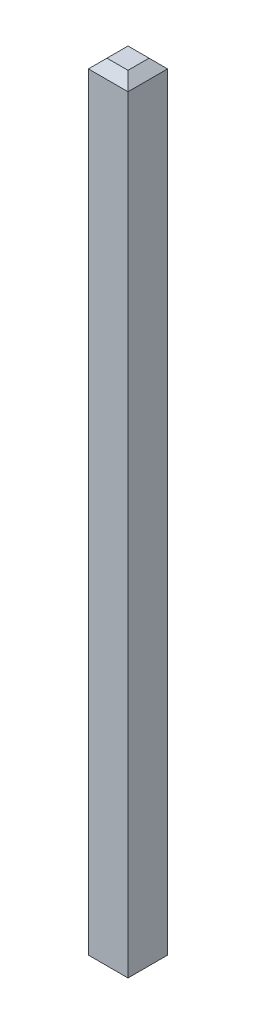
ISO-10303-21;
HEADER;
FILE_DESCRIPTION(('STEP AP214'),'2;1');
FILE_NAME('part.step','',(''),(''),'','','');
FILE_SCHEMA(('AUTOMOTIVE_DESIGN { 1 0 10303 214 1 1 1 1 }'));
ENDSEC;
DATA;
#1=APPLICATION_CONTEXT('core data for automotive mechanical design processes');
#2=APPLICATION_PROTOCOL_DEFINITION('international standard','automotive_design',2000,#1);
#3=PRODUCT_CONTEXT('',#1,'mechanical');
#4=PRODUCT('Part','Part','',(#3));
#5=PRODUCT_RELATED_PRODUCT_CATEGORY('part','',(#4));
#6=PRODUCT_DEFINITION_FORMATION('','',#4);
#7=PRODUCT_DEFINITION_CONTEXT('part definition',#1,'design');
#8=PRODUCT_DEFINITION('design','',#6,#7);
#9=PRODUCT_DEFINITION_SHAPE('','',#8);
#10=(LENGTH_UNIT() NAMED_UNIT(*) SI_UNIT(.MILLI.,.METRE.));
#11=(NAMED_UNIT(*) PLANE_ANGLE_UNIT() SI_UNIT($,.RADIAN.));
#12=(NAMED_UNIT(*) SI_UNIT($,.STERADIAN.) SOLID_ANGLE_UNIT());
#13=UNCERTAINTY_MEASURE_WITH_UNIT(LENGTH_MEASURE(1.E-05),#10,'distance_accuracy_value','');
#14=(GEOMETRIC_REPRESENTATION_CONTEXT(3) GLOBAL_UNCERTAINTY_ASSIGNED_CONTEXT((#13)) GLOBAL_UNIT_ASSIGNED_CONTEXT((#10,
#11,#12)) REPRESENTATION_CONTEXT('',''));
#15=CARTESIAN_POINT('',(0.,0.,0.));
#16=DIRECTION('',(0.,0.,1.));
#17=DIRECTION('',(1.,0.,0.));
#18=AXIS2_PLACEMENT_3D('',#15,#16,#17);
#19=CARTESIAN_POINT('',(3.565,-1.925,-0.16));
#20=DIRECTION('',(-0.707106781186548,-0.707106781186548,0.));
#21=DIRECTION('',(0.707106781186548,-0.707106781186548,0.));
#22=AXIS2_PLACEMENT_3D('',#19,#20,#21);
#23=PLANE('',#22);
#24=DIRECTION('',(0.,0.,1.));
#25=VECTOR('',#24,1.);
#26=CARTESIAN_POINT('',(3.49,-1.85,-0.32));
#27=LINE('',#26,#25);
#28=CARTESIAN_POINT('',(3.49,-1.85,-0.32));
#29=VERTEX_POINT('',#28);
#30=CARTESIAN_POINT('',(3.49,-1.85,0.32));
#31=VERTEX_POINT('',#30);
#32=EDGE_CURVE('E96',#29,#31,#27,.T.);
#33=ORIENTED_EDGE('',*,*,#32,.F.);
#34=DIRECTION('',(-0.577350269189625,0.577350269189627,-0.577350269189626));
#35=VECTOR('',#34,1.);
#36=CARTESIAN_POINT('',(3.64,-2.,-0.17));
#37=LINE('',#36,#35);
#38=CARTESIAN_POINT('',(3.64,-2.,-0.17));
#39=VERTEX_POINT('',#38);
#40=EDGE_CURVE('E94',#39,#29,#37,.T.);
#41=ORIENTED_EDGE('',*,*,#40,.F.);
#42=DIRECTION('',(0.,0.,1.));
#43=VECTOR('',#42,1.);
#44=CARTESIAN_POINT('',(3.64,-2.,0.));
#45=LINE('',#44,#43);
#46=CARTESIAN_POINT('',(3.64,-2.,0.17));
#47=VERTEX_POINT('',#46);
#48=EDGE_CURVE('E20',#39,#47,#45,.T.);
#49=ORIENTED_EDGE('',*,*,#48,.T.);
#50=DIRECTION('',(0.577350269189625,-0.577350269189627,-0.577350269189626));
#51=VECTOR('',#50,1.);
#52=CARTESIAN_POINT('',(3.49,-1.85,0.32));
#53=LINE('',#52,#51);
#54=EDGE_CURVE('E113',#31,#47,#53,.T.);
#55=ORIENTED_EDGE('',*,*,#54,.F.);
#56=EDGE_LOOP('',(#33,#41,#49,#55));
#57=FACE_BOUND('',#56,.T.);
#58=ADVANCED_FACE('F17',(#57),#23,.T.);
#59=CARTESIAN_POINT('',(3.565,10.625,-0.16));
#60=DIRECTION('',(-0.707106781186545,0.70710678118655,0.));
#61=DIRECTION('',(-0.70710678118655,-0.707106781186545,0.));
#62=AXIS2_PLACEMENT_3D('',#59,#60,#61);
#63=PLANE('',#62);
#64=DIRECTION('',(0.,0.,1.));
#65=VECTOR('',#64,1.);
#66=CARTESIAN_POINT('',(3.49,10.55,-0.32));
#67=LINE('',#66,#65);
#68=CARTESIAN_POINT('',(3.49,10.55,0.32));
#69=VERTEX_POINT('',#68);
#70=CARTESIAN_POINT('',(3.49,10.55,-0.32));
#71=VERTEX_POINT('',#70);
#72=EDGE_CURVE('E121',#69,#71,#67,.F.);
#73=ORIENTED_EDGE('',*,*,#72,.F.);
#74=DIRECTION('',(-0.577350269189626,-0.577350269189624,0.577350269189628));
#75=VECTOR('',#74,1.);
#76=CARTESIAN_POINT('',(3.64,10.7,0.170000000000001));
#77=LINE('',#76,#75);
#78=CARTESIAN_POINT('',(3.64,10.7,0.17));
#79=VERTEX_POINT('',#78);
#80=EDGE_CURVE('E118',#79,#69,#77,.T.);
#81=ORIENTED_EDGE('',*,*,#80,.F.);
#82=DIRECTION('',(0.,0.,1.));
#83=VECTOR('',#82,1.);
#84=CARTESIAN_POINT('',(3.64,10.7,0.));
#85=LINE('',#84,#83);
#86=CARTESIAN_POINT('',(3.64,10.7,-0.17));
#87=VERTEX_POINT('',#86);
#88=EDGE_CURVE('E79',#87,#79,#85,.T.);
#89=ORIENTED_EDGE('',*,*,#88,.F.);
#90=DIRECTION('',(0.577350269189626,0.577350269189624,0.577350269189628));
#91=VECTOR('',#90,1.);
#92=CARTESIAN_POINT('',(3.49,10.55,-0.320000000000001));
#93=LINE('',#92,#91);
#94=EDGE_CURVE('E106',#71,#87,#93,.T.);
#95=ORIENTED_EDGE('',*,*,#94,.F.);
#96=EDGE_LOOP('',(#73,#81,#89,#95));
#97=FACE_BOUND('',#96,.T.);
#98=ADVANCED_FACE('F283',(#97),#63,.T.);
#99=CARTESIAN_POINT('',(3.81,-2.,0.));
#100=DIRECTION('',(0.,1.,0.));
#101=DIRECTION('',(0.,0.,1.));
#102=AXIS2_PLACEMENT_3D('',#99,#100,#101);
#103=PLANE('',#102);
#104=DIRECTION('',(0.,0.,1.));
#105=VECTOR('',#104,1.);
#106=CARTESIAN_POINT('',(3.98,-2.,0.16));
#107=LINE('',#106,#105);
#108=CARTESIAN_POINT('',(3.98,-2.,0.17));
#109=VERTEX_POINT('',#108);
#110=CARTESIAN_POINT('',(3.98,-2.,-0.17));
#111=VERTEX_POINT('',#110);
#112=EDGE_CURVE('E127',#109,#111,#107,.F.);
#113=ORIENTED_EDGE('',*,*,#112,.F.);
#114=DIRECTION('',(1.,0.,0.));
#115=VECTOR('',#114,1.);
#116=CARTESIAN_POINT('',(3.65,-2.,0.17));
#117=LINE('',#116,#115);
#118=EDGE_CURVE('E90',#47,#109,#117,.T.);
#119=ORIENTED_EDGE('',*,*,#118,.F.);
#120=ORIENTED_EDGE('',*,*,#48,.F.);
#121=DIRECTION('',(1.,0.,0.));
#122=VECTOR('',#121,1.);
#123=CARTESIAN_POINT('',(3.97,-2.,-0.17));
#124=LINE('',#123,#122);
#125=EDGE_CURVE('E88',#111,#39,#124,.F.);
#126=ORIENTED_EDGE('',*,*,#125,.F.);
#127=EDGE_LOOP('',(#113,#119,#120,#126));
#128=FACE_BOUND('',#127,.T.);
#129=ADVANCED_FACE('F86',(#128),#103,.F.);
#130=CARTESIAN_POINT('',(3.97,-1.925,-0.245));
#131=DIRECTION('',(0.,-0.707106781186547,-0.707106781186548));
#132=DIRECTION('',(0.,0.707106781186548,-0.707106781186547));
#133=AXIS2_PLACEMENT_3D('',#130,#131,#132);
#134=PLANE('',#133);
#135=DIRECTION('',(-1.,0.,0.));
#136=VECTOR('',#135,1.);
#137=CARTESIAN_POINT('',(4.13,-1.85,-0.32));
#138=LINE('',#137,#136);
#139=CARTESIAN_POINT('',(4.13,-1.85,-0.32));
#140=VERTEX_POINT('',#139);
#141=EDGE_CURVE('E130',#140,#29,#138,.T.);
#142=ORIENTED_EDGE('',*,*,#141,.F.);
#143=DIRECTION('',(0.577350269189625,0.577350269189627,-0.577350269189626));
#144=VECTOR('',#143,1.);
#145=CARTESIAN_POINT('',(3.98,-2.,-0.17));
#146=LINE('',#145,#144);
#147=EDGE_CURVE('E102',#111,#140,#146,.T.);
#148=ORIENTED_EDGE('',*,*,#147,.F.);
#149=ORIENTED_EDGE('',*,*,#125,.T.);
#150=ORIENTED_EDGE('',*,*,#40,.T.);
#151=EDGE_LOOP('',(#142,#148,#149,#150));
#152=FACE_BOUND('',#151,.T.);
#153=ADVANCED_FACE('F100',(#152),#134,.T.);
#154=CARTESIAN_POINT('',(3.81,10.7,0.));
#155=DIRECTION('',(0.,1.,0.));
#156=DIRECTION('',(0.,0.,1.));
#157=AXIS2_PLACEMENT_3D('',#154,#155,#156);
#158=PLANE('',#157);
#159=ORIENTED_EDGE('',*,*,#88,.T.);
#160=DIRECTION('',(1.,0.,0.));
#161=VECTOR('',#160,1.);
#162=CARTESIAN_POINT('',(3.65,10.7,0.170000000000001));
#163=LINE('',#162,#161);
#164=CARTESIAN_POINT('',(3.98,10.7,0.17));
#165=VERTEX_POINT('',#164);
#166=EDGE_CURVE('E115',#165,#79,#163,.F.);
#167=ORIENTED_EDGE('',*,*,#166,.F.);
#168=DIRECTION('',(0.,0.,1.));
#169=VECTOR('',#168,1.);
#170=CARTESIAN_POINT('',(3.98,10.7,0.16));
#171=LINE('',#170,#169);
#172=CARTESIAN_POINT('',(3.98,10.7,-0.17));
#173=VERTEX_POINT('',#172);
#174=EDGE_CURVE('E139',#173,#165,#171,.T.);
#175=ORIENTED_EDGE('',*,*,#174,.F.);
#176=DIRECTION('',(1.,0.,0.));
#177=VECTOR('',#176,1.);
#178=CARTESIAN_POINT('',(3.97,10.7,-0.170000000000001));
#179=LINE('',#178,#177);
#180=EDGE_CURVE('E109',#87,#173,#179,.T.);
#181=ORIENTED_EDGE('',*,*,#180,.F.);
#182=EDGE_LOOP('',(#159,#167,#175,#181));
#183=FACE_BOUND('',#182,.T.);
#184=ADVANCED_FACE('F259',(#183),#158,.T.);
#185=CARTESIAN_POINT('',(3.97,10.625,-0.245));
#186=DIRECTION('',(0.,0.70710678118655,-0.707106781186545));
#187=DIRECTION('',(0.,0.707106781186545,0.70710678118655));
#188=AXIS2_PLACEMENT_3D('',#185,#186,#187);
#189=PLANE('',#188);
#190=ORIENTED_EDGE('',*,*,#180,.T.);
#191=DIRECTION('',(-0.577350269189627,0.577350269189623,0.577350269189627));
#192=VECTOR('',#191,1.);
#193=CARTESIAN_POINT('',(4.13,10.55,-0.32));
#194=LINE('',#193,#192);
#195=CARTESIAN_POINT('',(4.13,10.55,-0.32));
#196=VERTEX_POINT('',#195);
#197=EDGE_CURVE('E144',#196,#173,#194,.T.);
#198=ORIENTED_EDGE('',*,*,#197,.F.);
#199=DIRECTION('',(-1.,0.,0.));
#200=VECTOR('',#199,1.);
#201=CARTESIAN_POINT('',(4.13,10.55,-0.32));
#202=LINE('',#201,#200);
#203=EDGE_CURVE('E136',#71,#196,#202,.F.);
#204=ORIENTED_EDGE('',*,*,#203,.F.);
#205=ORIENTED_EDGE('',*,*,#94,.T.);
#206=EDGE_LOOP('',(#190,#198,#204,#205));
#207=FACE_BOUND('',#206,.T.);
#208=ADVANCED_FACE('F251',(#207),#189,.T.);
#209=CARTESIAN_POINT('',(3.65,-1.925,0.245));
#210=DIRECTION('',(0.,-0.707106781186547,0.707106781186548));
#211=DIRECTION('',(0.,-0.707106781186548,-0.707106781186547));
#212=AXIS2_PLACEMENT_3D('',#209,#210,#211);
#213=PLANE('',#212);
#214=DIRECTION('',(1.,0.,0.));
#215=VECTOR('',#214,1.);
#216=CARTESIAN_POINT('',(3.49,-1.85,0.32));
#217=LINE('',#216,#215);
#218=CARTESIAN_POINT('',(4.13,-1.85,0.32));
#219=VERTEX_POINT('',#218);
#220=EDGE_CURVE('E147',#31,#219,#217,.T.);
#221=ORIENTED_EDGE('',*,*,#220,.F.);
#222=ORIENTED_EDGE('',*,*,#54,.T.);
#223=ORIENTED_EDGE('',*,*,#118,.T.);
#224=DIRECTION('',(-0.577350269189625,-0.577350269189627,-0.577350269189626));
#225=VECTOR('',#224,1.);
#226=CARTESIAN_POINT('',(4.13,-1.85,0.32));
#227=LINE('',#226,#225);
#228=EDGE_CURVE('E124',#219,#109,#227,.T.);
#229=ORIENTED_EDGE('',*,*,#228,.F.);
#230=EDGE_LOOP('',(#221,#222,#223,#229));
#231=FACE_BOUND('',#230,.T.);
#232=ADVANCED_FACE('F173',(#231),#213,.T.);
#233=CARTESIAN_POINT('',(3.65,10.625,0.245));
#234=DIRECTION('',(0.,0.70710678118655,0.707106781186545));
#235=DIRECTION('',(0.,-0.707106781186545,0.70710678118655));
#236=AXIS2_PLACEMENT_3D('',#233,#234,#235);
#237=PLANE('',#236);
#238=DIRECTION('',(1.,0.,0.));
#239=VECTOR('',#238,1.);
#240=CARTESIAN_POINT('',(3.49,10.55,0.32));
#241=LINE('',#240,#239);
#242=CARTESIAN_POINT('',(4.13,10.55,0.32));
#243=VERTEX_POINT('',#242);
#244=EDGE_CURVE('E35',#243,#69,#241,.F.);
#245=ORIENTED_EDGE('',*,*,#244,.F.);
#246=DIRECTION('',(0.577350269189627,-0.577350269189623,0.577350269189627));
#247=VECTOR('',#246,1.);
#248=CARTESIAN_POINT('',(3.98,10.7,0.17));
#249=LINE('',#248,#247);
#250=EDGE_CURVE('E142',#165,#243,#249,.T.);
#251=ORIENTED_EDGE('',*,*,#250,.F.);
#252=ORIENTED_EDGE('',*,*,#166,.T.);
#253=ORIENTED_EDGE('',*,*,#80,.T.);
#254=EDGE_LOOP('',(#245,#251,#252,#253));
#255=FACE_BOUND('',#254,.T.);
#256=ADVANCED_FACE('F190',(#255),#237,.T.);
#257=CARTESIAN_POINT('',(3.49,-2.,-0.32));
#258=DIRECTION('',(-1.,0.,0.));
#259=DIRECTION('',(0.,0.,1.));
#260=AXIS2_PLACEMENT_3D('',#257,#258,#259);
#261=PLANE('',#260);
#262=ORIENTED_EDGE('',*,*,#72,.T.);
#263=DIRECTION('',(0.,1.,0.));
#264=VECTOR('',#263,1.);
#265=CARTESIAN_POINT('',(3.49,-2.,-0.32));
#266=LINE('',#265,#264);
#267=EDGE_CURVE('E133',#29,#71,#266,.T.);
#268=ORIENTED_EDGE('',*,*,#267,.F.);
#269=ORIENTED_EDGE('',*,*,#32,.T.);
#270=DIRECTION('',(0.,1.,0.));
#271=VECTOR('',#270,1.);
#272=CARTESIAN_POINT('',(3.49,-2.,0.32));
#273=LINE('',#272,#271);
#274=EDGE_CURVE('E151',#69,#31,#273,.F.);
#275=ORIENTED_EDGE('',*,*,#274,.F.);
#276=EDGE_LOOP('',(#262,#268,#269,#275));
#277=FACE_BOUND('',#276,.T.);
#278=ADVANCED_FACE('F176',(#277),#261,.T.);
#279=CARTESIAN_POINT('',(4.055,-1.925,0.16));
#280=DIRECTION('',(0.707106781186548,-0.707106781186548,0.));
#281=DIRECTION('',(0.707106781186548,0.707106781186548,0.));
#282=AXIS2_PLACEMENT_3D('',#279,#280,#281);
#283=PLANE('',#282);
#284=ORIENTED_EDGE('',*,*,#112,.T.);
#285=ORIENTED_EDGE('',*,*,#147,.T.);
#286=DIRECTION('',(0.,0.,-1.));
#287=VECTOR('',#286,1.);
#288=CARTESIAN_POINT('',(4.13,-1.85,0.32));
#289=LINE('',#288,#287);
#290=EDGE_CURVE('E154',#219,#140,#289,.T.);
#291=ORIENTED_EDGE('',*,*,#290,.F.);
#292=ORIENTED_EDGE('',*,*,#228,.T.);
#293=EDGE_LOOP('',(#284,#285,#291,#292));
#294=FACE_BOUND('',#293,.T.);
#295=ADVANCED_FACE('F181',(#294),#283,.T.);
#296=CARTESIAN_POINT('',(4.13,-2.,-0.32));
#297=DIRECTION('',(0.,0.,-1.));
#298=DIRECTION('',(-1.,0.,0.));
#299=AXIS2_PLACEMENT_3D('',#296,#297,#298);
#300=PLANE('',#299);
#301=ORIENTED_EDGE('',*,*,#203,.T.);
#302=DIRECTION('',(0.,1.,0.));
#303=VECTOR('',#302,1.);
#304=CARTESIAN_POINT('',(4.13,-2.,-0.32));
#305=LINE('',#304,#303);
#306=EDGE_CURVE('E157',#140,#196,#305,.T.);
#307=ORIENTED_EDGE('',*,*,#306,.F.);
#308=ORIENTED_EDGE('',*,*,#141,.T.);
#309=ORIENTED_EDGE('',*,*,#267,.T.);
#310=EDGE_LOOP('',(#301,#307,#308,#309));
#311=FACE_BOUND('',#310,.T.);
#312=ADVANCED_FACE('F179',(#311),#300,.T.);
#313=CARTESIAN_POINT('',(4.055,10.625,0.16));
#314=DIRECTION('',(0.707106781186545,0.70710678118655,0.));
#315=DIRECTION('',(-0.70710678118655,0.707106781186545,0.));
#316=AXIS2_PLACEMENT_3D('',#313,#314,#315);
#317=PLANE('',#316);
#318=DIRECTION('',(0.,0.,-1.));
#319=VECTOR('',#318,1.);
#320=CARTESIAN_POINT('',(4.13,10.55,0.32));
#321=LINE('',#320,#319);
#322=EDGE_CURVE('E26',#196,#243,#321,.F.);
#323=ORIENTED_EDGE('',*,*,#322,.F.);
#324=ORIENTED_EDGE('',*,*,#197,.T.);
#325=ORIENTED_EDGE('',*,*,#174,.T.);
#326=ORIENTED_EDGE('',*,*,#250,.T.);
#327=EDGE_LOOP('',(#323,#324,#325,#326));
#328=FACE_BOUND('',#327,.T.);
#329=ADVANCED_FACE('F167',(#328),#317,.T.);
#330=CARTESIAN_POINT('',(3.49,-2.,0.32));
#331=DIRECTION('',(0.,0.,1.));
#332=DIRECTION('',(1.,0.,0.));
#333=AXIS2_PLACEMENT_3D('',#330,#331,#332);
#334=PLANE('',#333);
#335=ORIENTED_EDGE('',*,*,#244,.T.);
#336=ORIENTED_EDGE('',*,*,#274,.T.);
#337=ORIENTED_EDGE('',*,*,#220,.T.);
#338=DIRECTION('',(0.,1.,0.));
#339=VECTOR('',#338,1.);
#340=CARTESIAN_POINT('',(4.13,-2.,0.32));
#341=LINE('',#340,#339);
#342=EDGE_CURVE('E11',#243,#219,#341,.F.);
#343=ORIENTED_EDGE('',*,*,#342,.F.);
#344=EDGE_LOOP('',(#335,#336,#337,#343));
#345=FACE_BOUND('',#344,.T.);
#346=ADVANCED_FACE('F169',(#345),#334,.T.);
#347=CARTESIAN_POINT('',(4.13,-2.,0.32));
#348=DIRECTION('',(1.,0.,0.));
#349=DIRECTION('',(0.,0.,-1.));
#350=AXIS2_PLACEMENT_3D('',#347,#348,#349);
#351=PLANE('',#350);
#352=ORIENTED_EDGE('',*,*,#322,.T.);
#353=ORIENTED_EDGE('',*,*,#342,.T.);
#354=ORIENTED_EDGE('',*,*,#290,.T.);
#355=ORIENTED_EDGE('',*,*,#306,.T.);
#356=EDGE_LOOP('',(#352,#353,#354,#355));
#357=FACE_BOUND('',#356,.T.);
#358=ADVANCED_FACE('F163',(#357),#351,.T.);
#359=CLOSED_SHELL('',(#58,#98,#129,#153,#184,#208,#232,#256,#278,#295,#312,#329,#346,#358));
#360=MANIFOLD_SOLID_BREP('B1',#359);
#361=ADVANCED_BREP_SHAPE_REPRESENTATION('',(#18,#360),#14);
#362=SHAPE_DEFINITION_REPRESENTATION(#9,#361);
ENDSEC;
END-ISO-10303-21;
